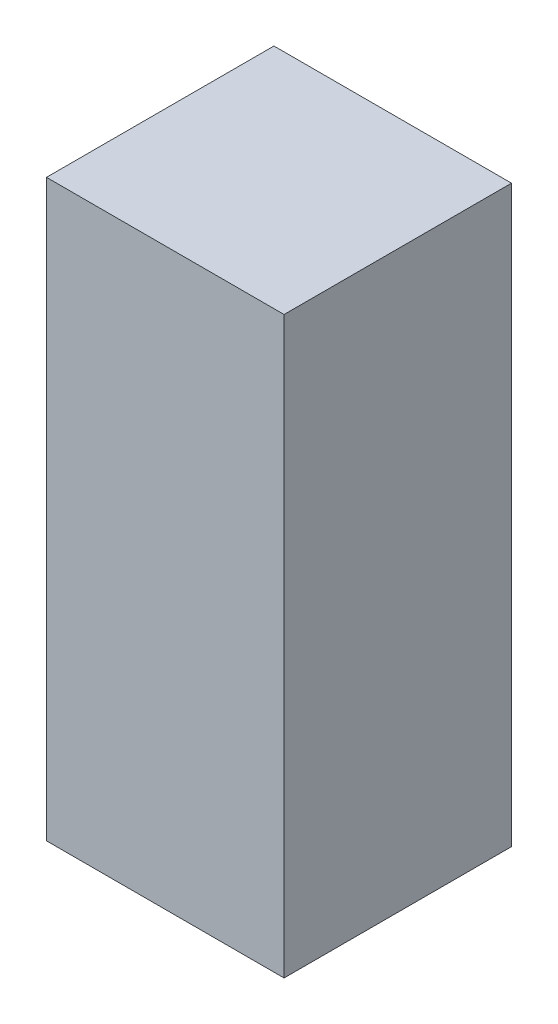
ISO-10303-21;
HEADER;
FILE_DESCRIPTION(('STEP AP214'),'2;1');
FILE_NAME('part.step','',(''),(''),'','','');
FILE_SCHEMA(('AUTOMOTIVE_DESIGN { 1 0 10303 214 1 1 1 1 }'));
ENDSEC;
DATA;
#1=APPLICATION_CONTEXT('core data for automotive mechanical design processes');
#2=APPLICATION_PROTOCOL_DEFINITION('international standard','automotive_design',2000,#1);
#3=PRODUCT_CONTEXT('',#1,'mechanical');
#4=PRODUCT('Part','Part','',(#3));
#5=PRODUCT_RELATED_PRODUCT_CATEGORY('part','',(#4));
#6=PRODUCT_DEFINITION_FORMATION('','',#4);
#7=PRODUCT_DEFINITION_CONTEXT('part definition',#1,'design');
#8=PRODUCT_DEFINITION('design','',#6,#7);
#9=PRODUCT_DEFINITION_SHAPE('','',#8);
#10=(LENGTH_UNIT() NAMED_UNIT(*) SI_UNIT(.MILLI.,.METRE.));
#11=(NAMED_UNIT(*) PLANE_ANGLE_UNIT() SI_UNIT($,.RADIAN.));
#12=(NAMED_UNIT(*) SI_UNIT($,.STERADIAN.) SOLID_ANGLE_UNIT());
#13=UNCERTAINTY_MEASURE_WITH_UNIT(LENGTH_MEASURE(1.E-05),#10,'distance_accuracy_value','');
#14=(GEOMETRIC_REPRESENTATION_CONTEXT(3) GLOBAL_UNCERTAINTY_ASSIGNED_CONTEXT((#13)) GLOBAL_UNIT_ASSIGNED_CONTEXT((#10,
#11,#12)) REPRESENTATION_CONTEXT('',''));
#15=CARTESIAN_POINT('',(0.,0.,0.));
#16=DIRECTION('',(0.,0.,1.));
#17=DIRECTION('',(1.,0.,0.));
#18=AXIS2_PLACEMENT_3D('',#15,#16,#17);
#19=CARTESIAN_POINT('',(-0.5969,1.4437995,1.143));
#20=DIRECTION('',(0.,0.,1.));
#21=DIRECTION('',(1.,0.,0.));
#22=AXIS2_PLACEMENT_3D('',#19,#20,#21);
#23=PLANE('',#22);
#24=DIRECTION('',(1.,0.,0.));
#25=VECTOR('',#24,1.);
#26=CARTESIAN_POINT('',(-0.5969,1.4437995,1.143));
#27=LINE('',#26,#25);
#28=CARTESIAN_POINT('',(-0.5969,1.4437995,1.143));
#29=VERTEX_POINT('',#28);
#30=CARTESIAN_POINT('',(0.5969,1.4437995,1.143));
#31=VERTEX_POINT('',#30);
#32=EDGE_CURVE('E104',#29,#31,#27,.T.);
#33=ORIENTED_EDGE('',*,*,#32,.F.);
#34=DIRECTION('',(0.,1.,0.));
#35=VECTOR('',#34,1.);
#36=CARTESIAN_POINT('',(-0.5969,-1.4437995,1.143));
#37=LINE('',#36,#35);
#38=CARTESIAN_POINT('',(-0.5969,-1.4437995,1.143));
#39=VERTEX_POINT('',#38);
#40=EDGE_CURVE('E28',#39,#29,#37,.T.);
#41=ORIENTED_EDGE('',*,*,#40,.F.);
#42=DIRECTION('',(-1.,0.,0.));
#43=VECTOR('',#42,1.);
#44=CARTESIAN_POINT('',(0.5969,-1.4437995,1.143));
#45=LINE('',#44,#43);
#46=CARTESIAN_POINT('',(0.5969,-1.4437995,1.143));
#47=VERTEX_POINT('',#46);
#48=EDGE_CURVE('E77',#47,#39,#45,.T.);
#49=ORIENTED_EDGE('',*,*,#48,.F.);
#50=DIRECTION('',(0.,-1.,0.));
#51=VECTOR('',#50,1.);
#52=CARTESIAN_POINT('',(0.5969,1.4437995,1.143));
#53=LINE('',#52,#51);
#54=EDGE_CURVE('E64',#31,#47,#53,.T.);
#55=ORIENTED_EDGE('',*,*,#54,.F.);
#56=EDGE_LOOP('',(#33,#41,#49,#55));
#57=FACE_BOUND('',#56,.T.);
#58=ADVANCED_FACE('F17',(#57),#23,.T.);
#59=CARTESIAN_POINT('',(-0.5969,1.4437995,0.));
#60=DIRECTION('',(0.,0.,1.));
#61=DIRECTION('',(1.,0.,0.));
#62=AXIS2_PLACEMENT_3D('',#59,#60,#61);
#63=PLANE('',#62);
#64=DIRECTION('',(1.,0.,0.));
#65=VECTOR('',#64,1.);
#66=CARTESIAN_POINT('',(-0.5969,1.4437995,0.));
#67=LINE('',#66,#65);
#68=CARTESIAN_POINT('',(-0.5969,1.4437995,0.));
#69=VERTEX_POINT('',#68);
#70=CARTESIAN_POINT('',(0.5969,1.4437995,0.));
#71=VERTEX_POINT('',#70);
#72=EDGE_CURVE('E91',#69,#71,#67,.T.);
#73=ORIENTED_EDGE('',*,*,#72,.T.);
#74=DIRECTION('',(0.,-1.,0.));
#75=VECTOR('',#74,1.);
#76=CARTESIAN_POINT('',(0.5969,1.4437995,0.));
#77=LINE('',#76,#75);
#78=CARTESIAN_POINT('',(0.5969,-1.4437995,0.));
#79=VERTEX_POINT('',#78);
#80=EDGE_CURVE('E72',#71,#79,#77,.T.);
#81=ORIENTED_EDGE('',*,*,#80,.T.);
#82=DIRECTION('',(-1.,0.,0.));
#83=VECTOR('',#82,1.);
#84=CARTESIAN_POINT('',(0.5969,-1.4437995,0.));
#85=LINE('',#84,#83);
#86=CARTESIAN_POINT('',(-0.5969,-1.4437995,0.));
#87=VERTEX_POINT('',#86);
#88=EDGE_CURVE('E83',#79,#87,#85,.T.);
#89=ORIENTED_EDGE('',*,*,#88,.T.);
#90=DIRECTION('',(0.,1.,0.));
#91=VECTOR('',#90,1.);
#92=CARTESIAN_POINT('',(-0.5969,-1.4437995,0.));
#93=LINE('',#92,#91);
#94=EDGE_CURVE('E11',#87,#69,#93,.T.);
#95=ORIENTED_EDGE('',*,*,#94,.T.);
#96=EDGE_LOOP('',(#73,#81,#89,#95));
#97=FACE_BOUND('',#96,.T.);
#98=ADVANCED_FACE('F89',(#97),#63,.F.);
#99=CARTESIAN_POINT('',(-0.5969,-1.4437995,0.));
#100=DIRECTION('',(-1.,0.,0.));
#101=DIRECTION('',(0.,0.,1.));
#102=AXIS2_PLACEMENT_3D('',#99,#100,#101);
#103=PLANE('',#102);
#104=DIRECTION('',(0.,0.,1.));
#105=VECTOR('',#104,1.);
#106=CARTESIAN_POINT('',(-0.5969,-1.4437995,0.));
#107=LINE('',#106,#105);
#108=EDGE_CURVE('E21',#87,#39,#107,.T.);
#109=ORIENTED_EDGE('',*,*,#108,.T.);
#110=ORIENTED_EDGE('',*,*,#40,.T.);
#111=DIRECTION('',(0.,0.,1.));
#112=VECTOR('',#111,1.);
#113=CARTESIAN_POINT('',(-0.5969,1.4437995,0.));
#114=LINE('',#113,#112);
#115=EDGE_CURVE('E110',#69,#29,#114,.T.);
#116=ORIENTED_EDGE('',*,*,#115,.F.);
#117=ORIENTED_EDGE('',*,*,#94,.F.);
#118=EDGE_LOOP('',(#109,#110,#116,#117));
#119=FACE_BOUND('',#118,.T.);
#120=ADVANCED_FACE('F118',(#119),#103,.T.);
#121=CARTESIAN_POINT('',(0.5969,-1.4437995,0.));
#122=DIRECTION('',(0.,-1.,0.));
#123=DIRECTION('',(0.,0.,-1.));
#124=AXIS2_PLACEMENT_3D('',#121,#122,#123);
#125=PLANE('',#124);
#126=DIRECTION('',(0.,0.,1.));
#127=VECTOR('',#126,1.);
#128=CARTESIAN_POINT('',(0.5969,-1.4437995,0.));
#129=LINE('',#128,#127);
#130=EDGE_CURVE('E85',#79,#47,#129,.T.);
#131=ORIENTED_EDGE('',*,*,#130,.T.);
#132=ORIENTED_EDGE('',*,*,#48,.T.);
#133=ORIENTED_EDGE('',*,*,#108,.F.);
#134=ORIENTED_EDGE('',*,*,#88,.F.);
#135=EDGE_LOOP('',(#131,#132,#133,#134));
#136=FACE_BOUND('',#135,.T.);
#137=ADVANCED_FACE('F84',(#136),#125,.T.);
#138=CARTESIAN_POINT('',(0.5969,1.4437995,0.));
#139=DIRECTION('',(1.,0.,0.));
#140=DIRECTION('',(0.,1.,0.));
#141=AXIS2_PLACEMENT_3D('',#138,#139,#140);
#142=PLANE('',#141);
#143=DIRECTION('',(0.,0.,1.));
#144=VECTOR('',#143,1.);
#145=CARTESIAN_POINT('',(0.5969,1.4437995,0.));
#146=LINE('',#145,#144);
#147=EDGE_CURVE('E105',#71,#31,#146,.T.);
#148=ORIENTED_EDGE('',*,*,#147,.T.);
#149=ORIENTED_EDGE('',*,*,#54,.T.);
#150=ORIENTED_EDGE('',*,*,#130,.F.);
#151=ORIENTED_EDGE('',*,*,#80,.F.);
#152=EDGE_LOOP('',(#148,#149,#150,#151));
#153=FACE_BOUND('',#152,.T.);
#154=ADVANCED_FACE('F19',(#153),#142,.T.);
#155=CARTESIAN_POINT('',(-0.5969,1.4437995,0.));
#156=DIRECTION('',(0.,1.,0.));
#157=DIRECTION('',(1.,0.,0.));
#158=AXIS2_PLACEMENT_3D('',#155,#156,#157);
#159=PLANE('',#158);
#160=ORIENTED_EDGE('',*,*,#115,.T.);
#161=ORIENTED_EDGE('',*,*,#32,.T.);
#162=ORIENTED_EDGE('',*,*,#147,.F.);
#163=ORIENTED_EDGE('',*,*,#72,.F.);
#164=EDGE_LOOP('',(#160,#161,#162,#163));
#165=FACE_BOUND('',#164,.T.);
#166=ADVANCED_FACE('F122',(#165),#159,.T.);
#167=CLOSED_SHELL('',(#58,#98,#120,#137,#154,#166));
#168=MANIFOLD_SOLID_BREP('B1',#167);
#169=ADVANCED_BREP_SHAPE_REPRESENTATION('',(#18,#168),#14);
#170=SHAPE_DEFINITION_REPRESENTATION(#9,#169);
ENDSEC;
END-ISO-10303-21;
